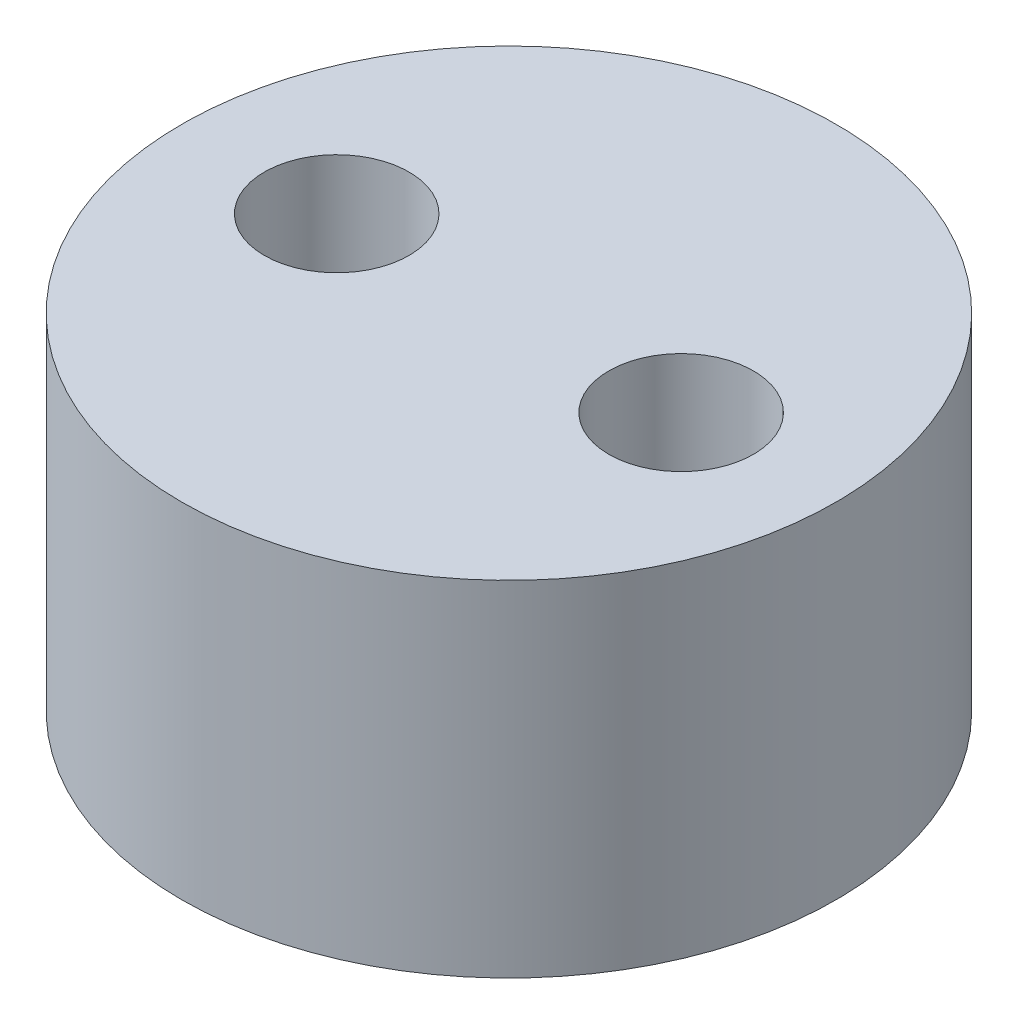
ISO-10303-21;
HEADER;
FILE_DESCRIPTION(('STEP AP214'),'2;1');
FILE_NAME('part.step','',(''),(''),'','','');
FILE_SCHEMA(('AUTOMOTIVE_DESIGN { 1 0 10303 214 1 1 1 1 }'));
ENDSEC;
DATA;
#1=APPLICATION_CONTEXT('core data for automotive mechanical design processes');
#2=APPLICATION_PROTOCOL_DEFINITION('international standard','automotive_design',2000,#1);
#3=PRODUCT_CONTEXT('',#1,'mechanical');
#4=PRODUCT('Part','Part','',(#3));
#5=PRODUCT_RELATED_PRODUCT_CATEGORY('part','',(#4));
#6=PRODUCT_DEFINITION_FORMATION('','',#4);
#7=PRODUCT_DEFINITION_CONTEXT('part definition',#1,'design');
#8=PRODUCT_DEFINITION('design','',#6,#7);
#9=PRODUCT_DEFINITION_SHAPE('','',#8);
#10=(LENGTH_UNIT() NAMED_UNIT(*) SI_UNIT(.MILLI.,.METRE.));
#11=(NAMED_UNIT(*) PLANE_ANGLE_UNIT() SI_UNIT($,.RADIAN.));
#12=(NAMED_UNIT(*) SI_UNIT($,.STERADIAN.) SOLID_ANGLE_UNIT());
#13=UNCERTAINTY_MEASURE_WITH_UNIT(LENGTH_MEASURE(1.E-05),#10,'distance_accuracy_value','');
#14=(GEOMETRIC_REPRESENTATION_CONTEXT(3) GLOBAL_UNCERTAINTY_ASSIGNED_CONTEXT((#13)) GLOBAL_UNIT_ASSIGNED_CONTEXT((#10,
#11,#12)) REPRESENTATION_CONTEXT('',''));
#15=CARTESIAN_POINT('',(0.,0.,0.));
#16=DIRECTION('',(0.,0.,1.));
#17=DIRECTION('',(1.,0.,0.));
#18=AXIS2_PLACEMENT_3D('',#15,#16,#17);
#19=CARTESIAN_POINT('',(0.,10.,0.));
#20=DIRECTION('',(0.,-1.,0.));
#21=DIRECTION('',(0.,0.,-1.));
#22=AXIS2_PLACEMENT_3D('',#19,#20,#21);
#23=CYLINDRICAL_SURFACE('',#22,9.5);
#24=CARTESIAN_POINT('',(0.,10.,0.));
#25=DIRECTION('',(0.,1.,0.));
#26=DIRECTION('',(0.,0.,1.));
#27=AXIS2_PLACEMENT_3D('',#24,#25,#26);
#28=CIRCLE('',#27,9.5);
#29=CARTESIAN_POINT('',(0.,10.,9.5));
#30=VERTEX_POINT('',#29);
#31=EDGE_CURVE('E10',#30,#30,#28,.T.);
#32=ORIENTED_EDGE('',*,*,#31,.F.);
#33=EDGE_LOOP('',(#32));
#34=FACE_BOUND('',#33,.T.);
#35=CARTESIAN_POINT('',(0.,0.,0.));
#36=DIRECTION('',(0.,1.,0.));
#37=DIRECTION('',(0.,0.,1.));
#38=AXIS2_PLACEMENT_3D('',#35,#36,#37);
#39=CIRCLE('',#38,9.5);
#40=CARTESIAN_POINT('',(0.,0.,9.5));
#41=VERTEX_POINT('',#40);
#42=EDGE_CURVE('E33',#41,#41,#39,.T.);
#43=ORIENTED_EDGE('',*,*,#42,.T.);
#44=EDGE_LOOP('',(#43));
#45=FACE_BOUND('',#44,.T.);
#46=ADVANCED_FACE('F30',(#34,#45),#23,.T.);
#47=CARTESIAN_POINT('',(0.,10.,0.));
#48=DIRECTION('',(0.,1.,0.));
#49=DIRECTION('',(0.,0.,1.));
#50=AXIS2_PLACEMENT_3D('',#47,#48,#49);
#51=PLANE('',#50);
#52=CARTESIAN_POINT('',(-5.,10.,0.));
#53=DIRECTION('',(0.,1.,0.));
#54=DIRECTION('',(0.,0.,1.));
#55=AXIS2_PLACEMENT_3D('',#52,#53,#54);
#56=CIRCLE('',#55,2.1);
#57=CARTESIAN_POINT('',(-5.,10.,2.1));
#58=VERTEX_POINT('',#57);
#59=EDGE_CURVE('E47',#58,#58,#56,.F.);
#60=ORIENTED_EDGE('',*,*,#59,.T.);
#61=EDGE_LOOP('',(#60));
#62=FACE_BOUND('',#61,.T.);
#63=CARTESIAN_POINT('',(5.,10.,0.));
#64=DIRECTION('',(0.,1.,0.));
#65=DIRECTION('',(0.,0.,1.));
#66=AXIS2_PLACEMENT_3D('',#63,#64,#65);
#67=CIRCLE('',#66,2.1);
#68=CARTESIAN_POINT('',(5.,10.,2.1));
#69=VERTEX_POINT('',#68);
#70=EDGE_CURVE('E40',#69,#69,#67,.T.);
#71=ORIENTED_EDGE('',*,*,#70,.F.);
#72=EDGE_LOOP('',(#71));
#73=FACE_BOUND('',#72,.T.);
#74=ORIENTED_EDGE('',*,*,#31,.T.);
#75=EDGE_LOOP('',(#74));
#76=FACE_BOUND('',#75,.T.);
#77=ADVANCED_FACE('F60',(#62,#73,#76),#51,.T.);
#78=CARTESIAN_POINT('',(0.,0.,0.));
#79=DIRECTION('',(0.,1.,0.));
#80=DIRECTION('',(0.,0.,1.));
#81=AXIS2_PLACEMENT_3D('',#78,#79,#80);
#82=PLANE('',#81);
#83=CARTESIAN_POINT('',(-5.,0.,0.));
#84=DIRECTION('',(0.,-1.,0.));
#85=DIRECTION('',(0.,0.,1.));
#86=AXIS2_PLACEMENT_3D('',#83,#84,#85);
#87=CIRCLE('',#86,2.1);
#88=CARTESIAN_POINT('',(-5.,0.,2.1));
#89=VERTEX_POINT('',#88);
#90=EDGE_CURVE('E50',#89,#89,#87,.T.);
#91=ORIENTED_EDGE('',*,*,#90,.F.);
#92=EDGE_LOOP('',(#91));
#93=FACE_BOUND('',#92,.T.);
#94=CARTESIAN_POINT('',(5.,0.,0.));
#95=DIRECTION('',(0.,1.,0.));
#96=DIRECTION('',(0.,0.,1.));
#97=AXIS2_PLACEMENT_3D('',#94,#95,#96);
#98=CIRCLE('',#97,2.1);
#99=CARTESIAN_POINT('',(5.,0.,2.1));
#100=VERTEX_POINT('',#99);
#101=EDGE_CURVE('E44',#100,#100,#98,.T.);
#102=ORIENTED_EDGE('',*,*,#101,.T.);
#103=EDGE_LOOP('',(#102));
#104=FACE_BOUND('',#103,.T.);
#105=ORIENTED_EDGE('',*,*,#42,.F.);
#106=EDGE_LOOP('',(#105));
#107=FACE_BOUND('',#106,.T.);
#108=ADVANCED_FACE('F56',(#93,#104,#107),#82,.F.);
#109=CARTESIAN_POINT('',(5.,0.,0.));
#110=DIRECTION('',(0.,1.,0.));
#111=DIRECTION('',(0.,0.,1.));
#112=AXIS2_PLACEMENT_3D('',#109,#110,#111);
#113=CYLINDRICAL_SURFACE('',#112,2.1);
#114=ORIENTED_EDGE('',*,*,#70,.T.);
#115=EDGE_LOOP('',(#114));
#116=FACE_BOUND('',#115,.T.);
#117=ORIENTED_EDGE('',*,*,#101,.F.);
#118=EDGE_LOOP('',(#117));
#119=FACE_BOUND('',#118,.T.);
#120=ADVANCED_FACE('F59',(#116,#119),#113,.F.);
#121=CARTESIAN_POINT('',(-5.,0.,0.));
#122=DIRECTION('',(0.,1.,0.));
#123=DIRECTION('',(0.,0.,1.));
#124=AXIS2_PLACEMENT_3D('',#121,#122,#123);
#125=CYLINDRICAL_SURFACE('',#124,2.1);
#126=ORIENTED_EDGE('',*,*,#59,.F.);
#127=EDGE_LOOP('',(#126));
#128=FACE_BOUND('',#127,.T.);
#129=ORIENTED_EDGE('',*,*,#90,.T.);
#130=EDGE_LOOP('',(#129));
#131=FACE_BOUND('',#130,.T.);
#132=ADVANCED_FACE('F54',(#128,#131),#125,.F.);
#133=CLOSED_SHELL('',(#46,#77,#108,#120,#132));
#134=MANIFOLD_SOLID_BREP('B2',#133);
#135=ADVANCED_BREP_SHAPE_REPRESENTATION('',(#18,#134),#14);
#136=SHAPE_DEFINITION_REPRESENTATION(#9,#135);
ENDSEC;
END-ISO-10303-21;
